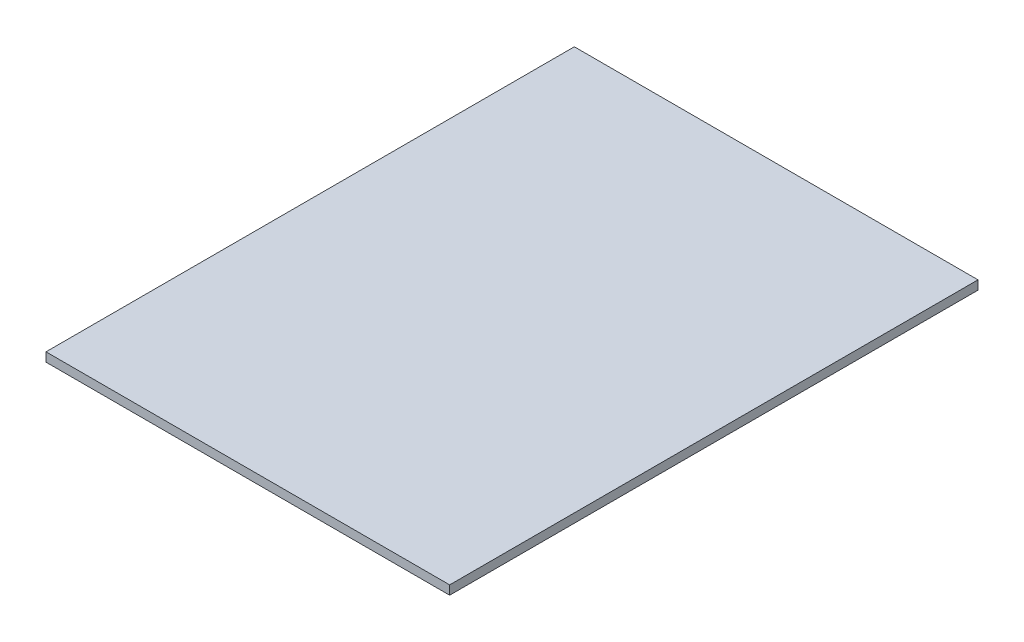
ISO-10303-21;
HEADER;
FILE_DESCRIPTION(('STEP AP214'),'2;1');
FILE_NAME('part.step','',(''),(''),'','','');
FILE_SCHEMA(('AUTOMOTIVE_DESIGN { 1 0 10303 214 1 1 1 1 }'));
ENDSEC;
DATA;
#1=APPLICATION_CONTEXT('core data for automotive mechanical design processes');
#2=APPLICATION_PROTOCOL_DEFINITION('international standard','automotive_design',2000,#1);
#3=PRODUCT_CONTEXT('',#1,'mechanical');
#4=PRODUCT('Part','Part','',(#3));
#5=PRODUCT_RELATED_PRODUCT_CATEGORY('part','',(#4));
#6=PRODUCT_DEFINITION_FORMATION('','',#4);
#7=PRODUCT_DEFINITION_CONTEXT('part definition',#1,'design');
#8=PRODUCT_DEFINITION('design','',#6,#7);
#9=PRODUCT_DEFINITION_SHAPE('','',#8);
#10=(LENGTH_UNIT() NAMED_UNIT(*) SI_UNIT(.MILLI.,.METRE.));
#11=(NAMED_UNIT(*) PLANE_ANGLE_UNIT() SI_UNIT($,.RADIAN.));
#12=(NAMED_UNIT(*) SI_UNIT($,.STERADIAN.) SOLID_ANGLE_UNIT());
#13=UNCERTAINTY_MEASURE_WITH_UNIT(LENGTH_MEASURE(1.E-05),#10,'distance_accuracy_value','');
#14=(GEOMETRIC_REPRESENTATION_CONTEXT(3) GLOBAL_UNCERTAINTY_ASSIGNED_CONTEXT((#13)) GLOBAL_UNIT_ASSIGNED_CONTEXT((#10,
#11,#12)) REPRESENTATION_CONTEXT('',''));
#15=CARTESIAN_POINT('',(0.,0.,0.));
#16=DIRECTION('',(0.,0.,1.));
#17=DIRECTION('',(1.,0.,0.));
#18=AXIS2_PLACEMENT_3D('',#15,#16,#17);
#19=CARTESIAN_POINT('',(0.,1.2,0.));
#20=DIRECTION('',(1.,0.,0.));
#21=DIRECTION('',(0.,0.,-1.));
#22=AXIS2_PLACEMENT_3D('',#19,#20,#21);
#23=PLANE('',#22);
#24=DIRECTION('',(0.,0.,1.));
#25=VECTOR('',#24,1.);
#26=CARTESIAN_POINT('',(0.,0.,0.));
#27=LINE('',#26,#25);
#28=CARTESIAN_POINT('',(0.,0.,-70.68));
#29=VERTEX_POINT('',#28);
#30=CARTESIAN_POINT('',(0.,0.,0.));
#31=VERTEX_POINT('',#30);
#32=EDGE_CURVE('E96',#29,#31,#27,.T.);
#33=ORIENTED_EDGE('',*,*,#32,.T.);
#34=DIRECTION('',(0.,-1.,0.));
#35=VECTOR('',#34,1.);
#36=CARTESIAN_POINT('',(0.,1.2,0.));
#37=LINE('',#36,#35);
#38=CARTESIAN_POINT('',(0.,1.2,0.));
#39=VERTEX_POINT('',#38);
#40=EDGE_CURVE('E11',#39,#31,#37,.T.);
#41=ORIENTED_EDGE('',*,*,#40,.F.);
#42=DIRECTION('',(0.,0.,1.));
#43=VECTOR('',#42,1.);
#44=CARTESIAN_POINT('',(0.,1.2,0.));
#45=LINE('',#44,#43);
#46=CARTESIAN_POINT('',(0.,1.2,-70.68));
#47=VERTEX_POINT('',#46);
#48=EDGE_CURVE('E84',#47,#39,#45,.T.);
#49=ORIENTED_EDGE('',*,*,#48,.F.);
#50=DIRECTION('',(0.,-1.,0.));
#51=VECTOR('',#50,1.);
#52=CARTESIAN_POINT('',(0.,1.2,-70.68));
#53=LINE('',#52,#51);
#54=EDGE_CURVE('E92',#47,#29,#53,.T.);
#55=ORIENTED_EDGE('',*,*,#54,.T.);
#56=EDGE_LOOP('',(#33,#41,#49,#55));
#57=FACE_BOUND('',#56,.T.);
#58=ADVANCED_FACE('F33',(#57),#23,.F.);
#59=CARTESIAN_POINT('',(0.,1.2,0.));
#60=DIRECTION('',(0.,0.,-1.));
#61=DIRECTION('',(-1.,0.,0.));
#62=AXIS2_PLACEMENT_3D('',#59,#60,#61);
#63=PLANE('',#62);
#64=DIRECTION('',(1.,0.,0.));
#65=VECTOR('',#64,1.);
#66=CARTESIAN_POINT('',(0.,0.,0.));
#67=LINE('',#66,#65);
#68=CARTESIAN_POINT('',(54.,0.,0.));
#69=VERTEX_POINT('',#68);
#70=EDGE_CURVE('E88',#31,#69,#67,.T.);
#71=ORIENTED_EDGE('',*,*,#70,.T.);
#72=DIRECTION('',(0.,-1.,0.));
#73=VECTOR('',#72,1.);
#74=CARTESIAN_POINT('',(54.,1.2,0.));
#75=LINE('',#74,#73);
#76=CARTESIAN_POINT('',(54.,1.2,0.));
#77=VERTEX_POINT('',#76);
#78=EDGE_CURVE('E41',#77,#69,#75,.T.);
#79=ORIENTED_EDGE('',*,*,#78,.F.);
#80=DIRECTION('',(1.,0.,0.));
#81=VECTOR('',#80,1.);
#82=CARTESIAN_POINT('',(0.,1.2,0.));
#83=LINE('',#82,#81);
#84=EDGE_CURVE('E79',#39,#77,#83,.T.);
#85=ORIENTED_EDGE('',*,*,#84,.F.);
#86=ORIENTED_EDGE('',*,*,#40,.T.);
#87=EDGE_LOOP('',(#71,#79,#85,#86));
#88=FACE_BOUND('',#87,.T.);
#89=ADVANCED_FACE('F87',(#88),#63,.F.);
#90=CARTESIAN_POINT('',(54.,1.2,0.));
#91=DIRECTION('',(-1.,0.,0.));
#92=DIRECTION('',(0.,0.,1.));
#93=AXIS2_PLACEMENT_3D('',#90,#91,#92);
#94=PLANE('',#93);
#95=DIRECTION('',(0.,0.,-1.));
#96=VECTOR('',#95,1.);
#97=CARTESIAN_POINT('',(54.,0.,0.));
#98=LINE('',#97,#96);
#99=CARTESIAN_POINT('',(54.,0.,-70.68));
#100=VERTEX_POINT('',#99);
#101=EDGE_CURVE('E66',#69,#100,#98,.T.);
#102=ORIENTED_EDGE('',*,*,#101,.T.);
#103=DIRECTION('',(0.,-1.,0.));
#104=VECTOR('',#103,1.);
#105=CARTESIAN_POINT('',(54.,1.2,-70.68));
#106=LINE('',#105,#104);
#107=CARTESIAN_POINT('',(54.,1.2,-70.68));
#108=VERTEX_POINT('',#107);
#109=EDGE_CURVE('E89',#108,#100,#106,.T.);
#110=ORIENTED_EDGE('',*,*,#109,.F.);
#111=DIRECTION('',(0.,0.,-1.));
#112=VECTOR('',#111,1.);
#113=CARTESIAN_POINT('',(54.,1.2,0.));
#114=LINE('',#113,#112);
#115=EDGE_CURVE('E82',#77,#108,#114,.T.);
#116=ORIENTED_EDGE('',*,*,#115,.F.);
#117=ORIENTED_EDGE('',*,*,#78,.T.);
#118=EDGE_LOOP('',(#102,#110,#116,#117));
#119=FACE_BOUND('',#118,.T.);
#120=ADVANCED_FACE('F90',(#119),#94,.F.);
#121=CARTESIAN_POINT('',(0.,1.2,-70.68));
#122=DIRECTION('',(0.,0.,1.));
#123=DIRECTION('',(1.,0.,0.));
#124=AXIS2_PLACEMENT_3D('',#121,#122,#123);
#125=PLANE('',#124);
#126=DIRECTION('',(-1.,0.,0.));
#127=VECTOR('',#126,1.);
#128=CARTESIAN_POINT('',(0.,0.,-70.68));
#129=LINE('',#128,#127);
#130=EDGE_CURVE('E72',#100,#29,#129,.T.);
#131=ORIENTED_EDGE('',*,*,#130,.T.);
#132=ORIENTED_EDGE('',*,*,#54,.F.);
#133=DIRECTION('',(-1.,0.,0.));
#134=VECTOR('',#133,1.);
#135=CARTESIAN_POINT('',(0.,1.2,-70.68));
#136=LINE('',#135,#134);
#137=EDGE_CURVE('E49',#108,#47,#136,.T.);
#138=ORIENTED_EDGE('',*,*,#137,.F.);
#139=ORIENTED_EDGE('',*,*,#109,.T.);
#140=EDGE_LOOP('',(#131,#132,#138,#139));
#141=FACE_BOUND('',#140,.T.);
#142=ADVANCED_FACE('F103',(#141),#125,.F.);
#143=CARTESIAN_POINT('',(0.,1.2,0.));
#144=DIRECTION('',(0.,-1.,0.));
#145=DIRECTION('',(0.,0.,-1.));
#146=AXIS2_PLACEMENT_3D('',#143,#144,#145);
#147=PLANE('',#146);
#148=ORIENTED_EDGE('',*,*,#48,.T.);
#149=ORIENTED_EDGE('',*,*,#84,.T.);
#150=ORIENTED_EDGE('',*,*,#115,.T.);
#151=ORIENTED_EDGE('',*,*,#137,.T.);
#152=EDGE_LOOP('',(#148,#149,#150,#151));
#153=FACE_BOUND('',#152,.T.);
#154=ADVANCED_FACE('F80',(#153),#147,.F.);
#155=CARTESIAN_POINT('',(0.,0.,0.));
#156=DIRECTION('',(0.,-1.,0.));
#157=DIRECTION('',(0.,0.,-1.));
#158=AXIS2_PLACEMENT_3D('',#155,#156,#157);
#159=PLANE('',#158);
#160=ORIENTED_EDGE('',*,*,#32,.F.);
#161=ORIENTED_EDGE('',*,*,#130,.F.);
#162=ORIENTED_EDGE('',*,*,#101,.F.);
#163=ORIENTED_EDGE('',*,*,#70,.F.);
#164=EDGE_LOOP('',(#160,#161,#162,#163));
#165=FACE_BOUND('',#164,.T.);
#166=ADVANCED_FACE('F106',(#165),#159,.T.);
#167=CLOSED_SHELL('',(#58,#89,#120,#142,#154,#166));
#168=MANIFOLD_SOLID_BREP('B2',#167);
#169=ADVANCED_BREP_SHAPE_REPRESENTATION('',(#18,#168),#14);
#170=SHAPE_DEFINITION_REPRESENTATION(#9,#169);
ENDSEC;
END-ISO-10303-21;
